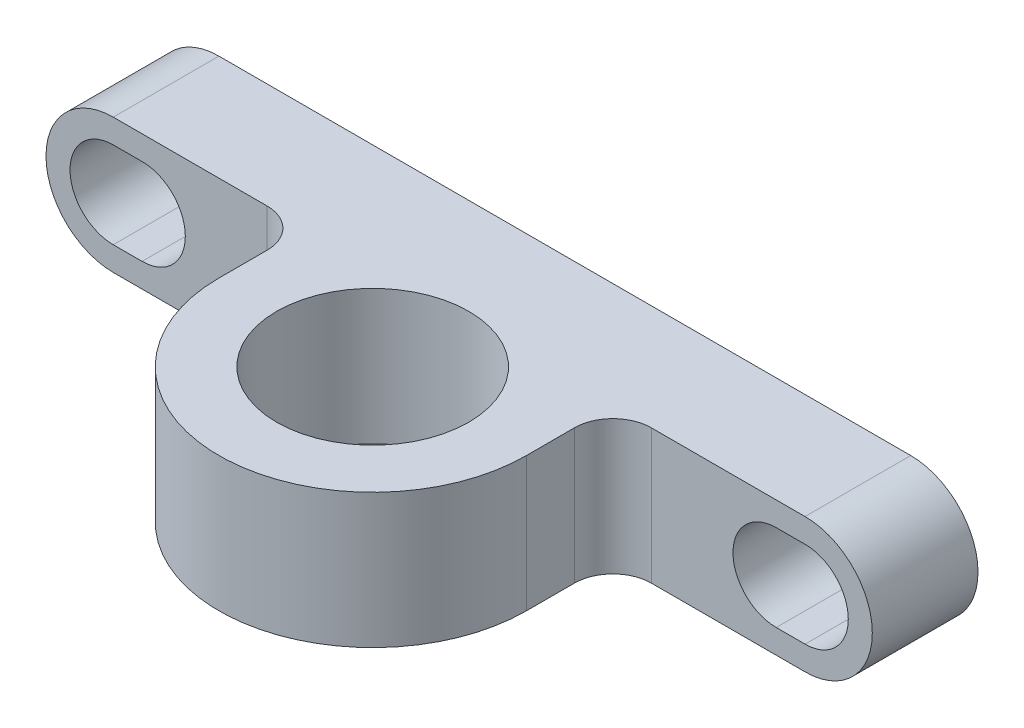
ISO-10303-21;
HEADER;
FILE_DESCRIPTION(('STEP AP214'),'2;1');
FILE_NAME('part.step','',(''),(''),'','','');
FILE_SCHEMA(('AUTOMOTIVE_DESIGN { 1 0 10303 214 1 1 1 1 }'));
ENDSEC;
DATA;
#1=APPLICATION_CONTEXT('core data for automotive mechanical design processes');
#2=APPLICATION_PROTOCOL_DEFINITION('international standard','automotive_design',2000,#1);
#3=PRODUCT_CONTEXT('',#1,'mechanical');
#4=PRODUCT('Part','Part','',(#3));
#5=PRODUCT_RELATED_PRODUCT_CATEGORY('part','',(#4));
#6=PRODUCT_DEFINITION_FORMATION('','',#4);
#7=PRODUCT_DEFINITION_CONTEXT('part definition',#1,'design');
#8=PRODUCT_DEFINITION('design','',#6,#7);
#9=PRODUCT_DEFINITION_SHAPE('','',#8);
#10=(LENGTH_UNIT() NAMED_UNIT(*) SI_UNIT(.MILLI.,.METRE.));
#11=(NAMED_UNIT(*) PLANE_ANGLE_UNIT() SI_UNIT($,.RADIAN.));
#12=(NAMED_UNIT(*) SI_UNIT($,.STERADIAN.) SOLID_ANGLE_UNIT());
#13=UNCERTAINTY_MEASURE_WITH_UNIT(LENGTH_MEASURE(1.E-05),#10,'distance_accuracy_value','');
#14=(GEOMETRIC_REPRESENTATION_CONTEXT(3) GLOBAL_UNCERTAINTY_ASSIGNED_CONTEXT((#13)) GLOBAL_UNIT_ASSIGNED_CONTEXT((#10,
#11,#12)) REPRESENTATION_CONTEXT('',''));
#15=CARTESIAN_POINT('',(0.,0.,0.));
#16=DIRECTION('',(0.,0.,1.));
#17=DIRECTION('',(1.,0.,0.));
#18=AXIS2_PLACEMENT_3D('',#15,#16,#17);
#19=CARTESIAN_POINT('',(0.,-3.5,-4.651828343263));
#20=DIRECTION('',(0.,-1.,0.));
#21=DIRECTION('',(0.,0.,-1.));
#22=AXIS2_PLACEMENT_3D('',#19,#20,#21);
#23=PLANE('',#22);
#24=DIRECTION('',(1.,0.,0.));
#25=VECTOR('',#24,1.);
#26=CARTESIAN_POINT('',(-17.9999735424187,-3.5,-4.5));
#27=LINE('',#26,#25);
#28=CARTESIAN_POINT('',(-17.9999867712094,-3.49999999995,-4.5));
#29=VERTEX_POINT('',#28);
#30=CARTESIAN_POINT('',(-10.0000000001,-3.5,-4.5));
#31=VERTEX_POINT('',#30);
#32=EDGE_CURVE('E467',#29,#31,#27,.T.);
#33=ORIENTED_EDGE('',*,*,#32,.F.);
#34=DIRECTION('',(0.,0.,-1.));
#35=VECTOR('',#34,1.);
#36=CARTESIAN_POINT('',(-18.,-3.5,-4.651828343263));
#37=LINE('',#36,#35);
#38=CARTESIAN_POINT('',(-18.,-3.49999999995,-10.));
#39=VERTEX_POINT('',#38);
#40=EDGE_CURVE('E211',#29,#39,#37,.T.);
#41=ORIENTED_EDGE('',*,*,#40,.T.);
#42=DIRECTION('',(1.,0.,0.));
#43=VECTOR('',#42,1.);
#44=CARTESIAN_POINT('',(0.,-3.5,-10.));
#45=LINE('',#44,#43);
#46=CARTESIAN_POINT('',(18.,-3.49999999995,-10.));
#47=VERTEX_POINT('',#46);
#48=EDGE_CURVE('E201',#39,#47,#45,.T.);
#49=ORIENTED_EDGE('',*,*,#48,.T.);
#50=DIRECTION('',(0.,0.,-1.));
#51=VECTOR('',#50,1.);
#52=CARTESIAN_POINT('',(18.,-3.5,-4.651828343263));
#53=LINE('',#52,#51);
#54=CARTESIAN_POINT('',(17.9999867712094,-3.49999999995,-4.49999999990001));
#55=VERTEX_POINT('',#54);
#56=EDGE_CURVE('E220',#47,#55,#53,.F.);
#57=ORIENTED_EDGE('',*,*,#56,.T.);
#58=DIRECTION('',(1.,0.,0.));
#59=VECTOR('',#58,1.);
#60=CARTESIAN_POINT('',(7.9999999999,-3.5,-4.49999999990001));
#61=LINE('',#60,#59);
#62=CARTESIAN_POINT('',(9.9999999999,-3.5,-4.49999999990001));
#63=VERTEX_POINT('',#62);
#64=EDGE_CURVE('E332',#63,#55,#61,.T.);
#65=ORIENTED_EDGE('',*,*,#64,.F.);
#66=CARTESIAN_POINT('',(9.9999999999,-3.5,-2.49999999990001));
#67=DIRECTION('',(0.,-1.,0.));
#68=DIRECTION('',(0.,0.,-1.));
#69=AXIS2_PLACEMENT_3D('',#66,#67,#68);
#70=CIRCLE('',#69,2.);
#71=CARTESIAN_POINT('',(7.9999999999,-3.5,-2.49999999990001));
#72=VERTEX_POINT('',#71);
#73=EDGE_CURVE('E56',#63,#72,#70,.F.);
#74=ORIENTED_EDGE('',*,*,#73,.T.);
#75=DIRECTION('',(0.,0.,1.));
#76=VECTOR('',#75,1.);
#77=CARTESIAN_POINT('',(7.9999999999,-3.5,-4.49999999990001));
#78=LINE('',#77,#76);
#79=CARTESIAN_POINT('',(7.9999999999,-3.5,0.));
#80=VERTEX_POINT('',#79);
#81=EDGE_CURVE('E448',#72,#80,#78,.T.);
#82=ORIENTED_EDGE('',*,*,#81,.T.);
#83=CARTESIAN_POINT('',(0.,-3.5,0.00126554336339));
#84=DIRECTION('',(0.,1.,0.));
#85=DIRECTION('',(0.,0.,1.));
#86=AXIS2_PLACEMENT_3D('',#83,#84,#85);
#87=CIRCLE('',#86,8.0000001);
#88=CARTESIAN_POINT('',(-8.,-3.5,0.));
#89=VERTEX_POINT('',#88);
#90=EDGE_CURVE('E217',#80,#89,#87,.F.);
#91=ORIENTED_EDGE('',*,*,#90,.T.);
#92=DIRECTION('',(0.,0.,1.));
#93=VECTOR('',#92,1.);
#94=CARTESIAN_POINT('',(-8.0000000001,-3.5,-4.5));
#95=LINE('',#94,#93);
#96=CARTESIAN_POINT('',(-8.0000000001,-3.5,-2.5));
#97=VERTEX_POINT('',#96);
#98=EDGE_CURVE('E183',#97,#89,#95,.T.);
#99=ORIENTED_EDGE('',*,*,#98,.F.);
#100=CARTESIAN_POINT('',(-10.0000000001,-3.5,-2.5));
#101=DIRECTION('',(0.,-1.,0.));
#102=DIRECTION('',(0.,0.,-1.));
#103=AXIS2_PLACEMENT_3D('',#100,#101,#102);
#104=CIRCLE('',#103,2.);
#105=EDGE_CURVE('E319',#97,#31,#104,.F.);
#106=ORIENTED_EDGE('',*,*,#105,.T.);
#107=EDGE_LOOP('',(#33,#41,#49,#57,#65,#74,#82,#91,#99,#106));
#108=FACE_BOUND('',#107,.T.);
#109=CARTESIAN_POINT('',(0.,-3.5,0.));
#110=DIRECTION('',(0.,-1.,0.));
#111=DIRECTION('',(0.,0.,-1.));
#112=AXIS2_PLACEMENT_3D('',#109,#110,#111);
#113=CIRCLE('',#112,5.);
#114=CARTESIAN_POINT('',(0.,-3.5,-5.));
#115=VERTEX_POINT('',#114);
#116=EDGE_CURVE('E496',#115,#115,#113,.T.);
#117=ORIENTED_EDGE('',*,*,#116,.F.);
#118=EDGE_LOOP('',(#117));
#119=FACE_BOUND('',#118,.T.);
#120=ADVANCED_FACE('F48',(#108,#119),#23,.T.);
#121=CARTESIAN_POINT('',(0.,3.5,-4.651828343263));
#122=DIRECTION('',(0.,-1.,0.));
#123=DIRECTION('',(0.,0.,-1.));
#124=AXIS2_PLACEMENT_3D('',#121,#122,#123);
#125=PLANE('',#124);
#126=DIRECTION('',(0.,0.,-1.));
#127=VECTOR('',#126,1.);
#128=CARTESIAN_POINT('',(-18.,3.5,-4.651828343263));
#129=LINE('',#128,#127);
#130=CARTESIAN_POINT('',(-17.9999867712094,3.5000000001,-4.5));
#131=VERTEX_POINT('',#130);
#132=CARTESIAN_POINT('',(-18.,3.49999999995,-10.));
#133=VERTEX_POINT('',#132);
#134=EDGE_CURVE('E200',#131,#133,#129,.T.);
#135=ORIENTED_EDGE('',*,*,#134,.F.);
#136=DIRECTION('',(-1.,0.,0.));
#137=VECTOR('',#136,1.);
#138=CARTESIAN_POINT('',(-8.0000000001,3.50000000015,-4.5));
#139=LINE('',#138,#137);
#140=CARTESIAN_POINT('',(-10.0000000001,3.50000000015,-4.5));
#141=VERTEX_POINT('',#140);
#142=EDGE_CURVE('E465',#141,#131,#139,.T.);
#143=ORIENTED_EDGE('',*,*,#142,.F.);
#144=CARTESIAN_POINT('',(-10.0000000001,3.5,-2.5));
#145=DIRECTION('',(0.,-1.,0.));
#146=DIRECTION('',(0.,0.,-1.));
#147=AXIS2_PLACEMENT_3D('',#144,#145,#146);
#148=CIRCLE('',#147,2.);
#149=CARTESIAN_POINT('',(-8.0000000001,3.50000000015,-2.5));
#150=VERTEX_POINT('',#149);
#151=EDGE_CURVE('E179',#141,#150,#148,.T.);
#152=ORIENTED_EDGE('',*,*,#151,.T.);
#153=DIRECTION('',(0.,0.,1.));
#154=VECTOR('',#153,1.);
#155=CARTESIAN_POINT('',(-8.0000000001,3.50000000015,-4.5));
#156=LINE('',#155,#154);
#157=CARTESIAN_POINT('',(-8.0000000001,3.50000000015,0.));
#158=VERTEX_POINT('',#157);
#159=EDGE_CURVE('E171',#150,#158,#156,.T.);
#160=ORIENTED_EDGE('',*,*,#159,.T.);
#161=CARTESIAN_POINT('',(0.,3.5,0.00126554336339));
#162=DIRECTION('',(0.,1.,0.));
#163=DIRECTION('',(0.,0.,1.));
#164=AXIS2_PLACEMENT_3D('',#161,#162,#163);
#165=CIRCLE('',#164,8.0000001);
#166=CARTESIAN_POINT('',(7.999999999925,3.5,0.));
#167=VERTEX_POINT('',#166);
#168=EDGE_CURVE('E177',#167,#158,#165,.F.);
#169=ORIENTED_EDGE('',*,*,#168,.F.);
#170=DIRECTION('',(0.,0.,1.));
#171=VECTOR('',#170,1.);
#172=CARTESIAN_POINT('',(7.9999999999,3.50000000015,-4.49999999990001));
#173=LINE('',#172,#171);
#174=CARTESIAN_POINT('',(7.9999999999,3.50000000015,-2.49999999990001));
#175=VERTEX_POINT('',#174);
#176=EDGE_CURVE('E335',#175,#167,#173,.T.);
#177=ORIENTED_EDGE('',*,*,#176,.F.);
#178=CARTESIAN_POINT('',(9.9999999999,3.5,-2.49999999990001));
#179=DIRECTION('',(0.,-1.,0.));
#180=DIRECTION('',(0.,0.,-1.));
#181=AXIS2_PLACEMENT_3D('',#178,#179,#180);
#182=CIRCLE('',#181,2.);
#183=CARTESIAN_POINT('',(9.9999999999,3.50000000015,-4.49999999990001));
#184=VERTEX_POINT('',#183);
#185=EDGE_CURVE('E13',#175,#184,#182,.T.);
#186=ORIENTED_EDGE('',*,*,#185,.T.);
#187=DIRECTION('',(-1.,0.,0.));
#188=VECTOR('',#187,1.);
#189=CARTESIAN_POINT('',(17.9999735424187,3.50000000015,-4.49999999990001));
#190=LINE('',#189,#188);
#191=CARTESIAN_POINT('',(17.9999867712094,3.5000000001,-4.49999999990001));
#192=VERTEX_POINT('',#191);
#193=EDGE_CURVE('E336',#192,#184,#190,.T.);
#194=ORIENTED_EDGE('',*,*,#193,.F.);
#195=DIRECTION('',(0.,0.,-1.));
#196=VECTOR('',#195,1.);
#197=CARTESIAN_POINT('',(18.,3.5,-4.651828343263));
#198=LINE('',#197,#196);
#199=CARTESIAN_POINT('',(18.,3.49999999995,-10.));
#200=VERTEX_POINT('',#199);
#201=EDGE_CURVE('E369',#200,#192,#198,.F.);
#202=ORIENTED_EDGE('',*,*,#201,.F.);
#203=DIRECTION('',(1.,0.,0.));
#204=VECTOR('',#203,1.);
#205=CARTESIAN_POINT('',(0.,3.5,-10.));
#206=LINE('',#205,#204);
#207=EDGE_CURVE('E208',#133,#200,#206,.T.);
#208=ORIENTED_EDGE('',*,*,#207,.F.);
#209=EDGE_LOOP('',(#135,#143,#152,#160,#169,#177,#186,#194,#202,#208));
#210=FACE_BOUND('',#209,.T.);
#211=CARTESIAN_POINT('',(0.,3.5,0.));
#212=DIRECTION('',(0.,-1.,0.));
#213=DIRECTION('',(0.,0.,-1.));
#214=AXIS2_PLACEMENT_3D('',#211,#212,#213);
#215=CIRCLE('',#214,5.);
#216=CARTESIAN_POINT('',(0.,3.5,-5.));
#217=VERTEX_POINT('',#216);
#218=EDGE_CURVE('E490',#217,#217,#215,.F.);
#219=ORIENTED_EDGE('',*,*,#218,.F.);
#220=EDGE_LOOP('',(#219));
#221=FACE_BOUND('',#220,.T.);
#222=ADVANCED_FACE('F174',(#210,#221),#125,.F.);
#223=CARTESIAN_POINT('',(-18.,2.2499999999,-10.));
#224=DIRECTION('',(0.,1.,0.));
#225=DIRECTION('',(0.,0.,1.));
#226=AXIS2_PLACEMENT_3D('',#223,#224,#225);
#227=PLANE('',#226);
#228=DIRECTION('',(-1.,0.,0.));
#229=VECTOR('',#228,1.);
#230=CARTESIAN_POINT('',(-18.0000212132043,2.2499999999,-4.5));
#231=LINE('',#230,#229);
#232=CARTESIAN_POINT('',(-16.4999893933978,2.2499999999,-4.5));
#233=VERTEX_POINT('',#232);
#234=CARTESIAN_POINT('',(-18.0000106066022,2.2499999999,-4.5));
#235=VERTEX_POINT('',#234);
#236=EDGE_CURVE('E473',#233,#235,#231,.T.);
#237=ORIENTED_EDGE('',*,*,#236,.T.);
#238=DIRECTION('',(0.,0.,-1.));
#239=VECTOR('',#238,1.);
#240=CARTESIAN_POINT('',(-18.,2.2499999999,-10.));
#241=LINE('',#240,#239);
#242=CARTESIAN_POINT('',(-18.,2.2499999999,-10.));
#243=VERTEX_POINT('',#242);
#244=EDGE_CURVE('E705',#235,#243,#241,.T.);
#245=ORIENTED_EDGE('',*,*,#244,.T.);
#246=DIRECTION('',(1.,0.,0.));
#247=VECTOR('',#246,1.);
#248=CARTESIAN_POINT('',(-18.,2.2499999999,-10.));
#249=LINE('',#248,#247);
#250=CARTESIAN_POINT('',(-16.5,2.2499999999,-10.));
#251=VERTEX_POINT('',#250);
#252=EDGE_CURVE('E215',#251,#243,#249,.F.);
#253=ORIENTED_EDGE('',*,*,#252,.F.);
#254=DIRECTION('',(0.,0.,-1.));
#255=VECTOR('',#254,1.);
#256=CARTESIAN_POINT('',(-16.5,2.2499999999,-10.));
#257=LINE('',#256,#255);
#258=EDGE_CURVE('E708',#251,#233,#257,.F.);
#259=ORIENTED_EDGE('',*,*,#258,.T.);
#260=EDGE_LOOP('',(#237,#245,#253,#259));
#261=FACE_BOUND('',#260,.T.);
#262=ADVANCED_FACE('F301',(#261),#227,.F.);
#263=CARTESIAN_POINT('',(-17.25,-2.25,-10.));
#264=DIRECTION('',(0.,-1.,0.));
#265=DIRECTION('',(0.,0.,-1.));
#266=AXIS2_PLACEMENT_3D('',#263,#264,#265);
#267=PLANE('',#266);
#268=DIRECTION('',(1.,0.,0.));
#269=VECTOR('',#268,1.);
#270=CARTESIAN_POINT('',(-16.4999787867957,-2.25000000015,-4.5));
#271=LINE('',#270,#269);
#272=CARTESIAN_POINT('',(-18.0000106066022,-2.25000000015,-4.5));
#273=VERTEX_POINT('',#272);
#274=CARTESIAN_POINT('',(-16.4999893933978,-2.25000000015,-4.5));
#275=VERTEX_POINT('',#274);
#276=EDGE_CURVE('E489',#273,#275,#271,.T.);
#277=ORIENTED_EDGE('',*,*,#276,.T.);
#278=DIRECTION('',(0.,0.,-1.));
#279=VECTOR('',#278,1.);
#280=CARTESIAN_POINT('',(-16.5,-2.2499999999,-10.));
#281=LINE('',#280,#279);
#282=CARTESIAN_POINT('',(-16.5,-2.24999999995,-10.));
#283=VERTEX_POINT('',#282);
#284=EDGE_CURVE('E712',#275,#283,#281,.T.);
#285=ORIENTED_EDGE('',*,*,#284,.T.);
#286=DIRECTION('',(1.,0.,0.));
#287=VECTOR('',#286,1.);
#288=CARTESIAN_POINT('',(-17.25,-2.25,-10.));
#289=LINE('',#288,#287);
#290=CARTESIAN_POINT('',(-18.,-2.24999999995,-10.));
#291=VERTEX_POINT('',#290);
#292=EDGE_CURVE('E436',#291,#283,#289,.T.);
#293=ORIENTED_EDGE('',*,*,#292,.F.);
#294=DIRECTION('',(0.,0.,-1.));
#295=VECTOR('',#294,1.);
#296=CARTESIAN_POINT('',(-18.,-2.2499999999,-10.));
#297=LINE('',#296,#295);
#298=EDGE_CURVE('E430',#291,#273,#297,.F.);
#299=ORIENTED_EDGE('',*,*,#298,.T.);
#300=EDGE_LOOP('',(#277,#285,#293,#299));
#301=FACE_BOUND('',#300,.T.);
#302=ADVANCED_FACE('F291',(#301),#267,.F.);
#303=CARTESIAN_POINT('',(-18.0000212132043,0.,-10.));
#304=DIRECTION('',(0.,0.,-1.));
#305=DIRECTION('',(-1.,0.,0.));
#306=AXIS2_PLACEMENT_3D('',#303,#304,#305);
#307=CYLINDRICAL_SURFACE('',#306,2.25);
#308=ORIENTED_EDGE('',*,*,#244,.F.);
#309=CARTESIAN_POINT('',(-18.0000212132043,-1.24999826461868E-10,-4.5));
#310=DIRECTION('',(0.,0.,1.));
#311=DIRECTION('',(-1.,0.,0.));
#312=AXIS2_PLACEMENT_3D('',#309,#310,#311);
#313=CIRCLE('',#312,2.250000000025);
#314=EDGE_CURVE('E487',#235,#273,#313,.T.);
#315=ORIENTED_EDGE('',*,*,#314,.T.);
#316=ORIENTED_EDGE('',*,*,#298,.F.);
#317=CARTESIAN_POINT('',(-18.0000212132043,0.,-10.));
#318=DIRECTION('',(0.,0.,-1.));
#319=DIRECTION('',(-1.,0.,0.));
#320=AXIS2_PLACEMENT_3D('',#317,#318,#319);
#321=CIRCLE('',#320,2.25);
#322=EDGE_CURVE('E803',#243,#291,#321,.F.);
#323=ORIENTED_EDGE('',*,*,#322,.F.);
#324=EDGE_LOOP('',(#308,#315,#316,#323));
#325=FACE_BOUND('',#324,.T.);
#326=ADVANCED_FACE('F274',(#325),#307,.F.);
#327=CARTESIAN_POINT('',(-17.9999735424187,0.,0.));
#328=DIRECTION('',(0.,0.,1.));
#329=DIRECTION('',(1.,0.,0.));
#330=AXIS2_PLACEMENT_3D('',#327,#328,#329);
#331=CYLINDRICAL_SURFACE('',#330,3.5);
#332=ORIENTED_EDGE('',*,*,#40,.F.);
#333=CARTESIAN_POINT('',(-17.9999735424187,7.50003566196503E-11,-4.5));
#334=DIRECTION('',(0.,0.,1.));
#335=DIRECTION('',(1.,0.,0.));
#336=AXIS2_PLACEMENT_3D('',#333,#334,#335);
#337=CIRCLE('',#336,3.500000000075);
#338=EDGE_CURVE('E471',#131,#29,#337,.T.);
#339=ORIENTED_EDGE('',*,*,#338,.F.);
#340=ORIENTED_EDGE('',*,*,#134,.T.);
#341=CARTESIAN_POINT('',(-17.9999735424187,0.,-10.));
#342=DIRECTION('',(0.,0.,1.));
#343=DIRECTION('',(1.,0.,0.));
#344=AXIS2_PLACEMENT_3D('',#341,#342,#343);
#345=CIRCLE('',#344,3.5);
#346=EDGE_CURVE('E193',#39,#133,#345,.F.);
#347=ORIENTED_EDGE('',*,*,#346,.F.);
#348=EDGE_LOOP('',(#332,#339,#340,#347));
#349=FACE_BOUND('',#348,.T.);
#350=ADVANCED_FACE('F270',(#349),#331,.T.);
#351=CARTESIAN_POINT('',(16.5,2.2499999999,-10.));
#352=DIRECTION('',(0.,1.,0.));
#353=DIRECTION('',(0.,0.,1.));
#354=AXIS2_PLACEMENT_3D('',#351,#352,#353);
#355=PLANE('',#354);
#356=DIRECTION('',(-1.,0.,0.));
#357=VECTOR('',#356,1.);
#358=CARTESIAN_POINT('',(16.4999787867957,2.2499999999,-4.49999999990001));
#359=LINE('',#358,#357);
#360=CARTESIAN_POINT('',(18.0000106066022,2.2499999999,-4.49999999990001));
#361=VERTEX_POINT('',#360);
#362=CARTESIAN_POINT('',(16.4999893933978,2.2499999999,-4.49999999990001));
#363=VERTEX_POINT('',#362);
#364=EDGE_CURVE('E359',#361,#363,#359,.T.);
#365=ORIENTED_EDGE('',*,*,#364,.T.);
#366=DIRECTION('',(0.,0.,-1.));
#367=VECTOR('',#366,1.);
#368=CARTESIAN_POINT('',(16.5,2.2499999999,-10.));
#369=LINE('',#368,#367);
#370=CARTESIAN_POINT('',(16.5,2.2499999999,-10.));
#371=VERTEX_POINT('',#370);
#372=EDGE_CURVE('E385',#363,#371,#369,.T.);
#373=ORIENTED_EDGE('',*,*,#372,.T.);
#374=DIRECTION('',(1.,0.,0.));
#375=VECTOR('',#374,1.);
#376=CARTESIAN_POINT('',(16.5,2.2499999999,-10.));
#377=LINE('',#376,#375);
#378=CARTESIAN_POINT('',(18.,2.2499999999,-10.));
#379=VERTEX_POINT('',#378);
#380=EDGE_CURVE('E431',#379,#371,#377,.F.);
#381=ORIENTED_EDGE('',*,*,#380,.F.);
#382=DIRECTION('',(0.,0.,-1.));
#383=VECTOR('',#382,1.);
#384=CARTESIAN_POINT('',(18.,2.2499999999,-10.));
#385=LINE('',#384,#383);
#386=EDGE_CURVE('E738',#379,#361,#385,.F.);
#387=ORIENTED_EDGE('',*,*,#386,.T.);
#388=EDGE_LOOP('',(#365,#373,#381,#387));
#389=FACE_BOUND('',#388,.T.);
#390=ADVANCED_FACE('F273',(#389),#355,.F.);
#391=CARTESIAN_POINT('',(17.25,-2.25,-10.));
#392=DIRECTION('',(0.,-1.,0.));
#393=DIRECTION('',(0.,0.,-1.));
#394=AXIS2_PLACEMENT_3D('',#391,#392,#393);
#395=PLANE('',#394);
#396=DIRECTION('',(1.,0.,0.));
#397=VECTOR('',#396,1.);
#398=CARTESIAN_POINT('',(18.0000212132043,-2.25000000015,-4.49999999990001));
#399=LINE('',#398,#397);
#400=CARTESIAN_POINT('',(16.4999893933978,-2.25000000015,-4.49999999990001));
#401=VERTEX_POINT('',#400);
#402=CARTESIAN_POINT('',(18.0000106066022,-2.25000000015,-4.49999999990001));
#403=VERTEX_POINT('',#402);
#404=EDGE_CURVE('E343',#401,#403,#399,.T.);
#405=ORIENTED_EDGE('',*,*,#404,.T.);
#406=DIRECTION('',(0.,0.,-1.));
#407=VECTOR('',#406,1.);
#408=CARTESIAN_POINT('',(18.,-2.2499999999,-10.));
#409=LINE('',#408,#407);
#410=CARTESIAN_POINT('',(18.,-2.24999999995,-10.));
#411=VERTEX_POINT('',#410);
#412=EDGE_CURVE('E400',#403,#411,#409,.T.);
#413=ORIENTED_EDGE('',*,*,#412,.T.);
#414=DIRECTION('',(1.,0.,0.));
#415=VECTOR('',#414,1.);
#416=CARTESIAN_POINT('',(17.25,-2.25,-10.));
#417=LINE('',#416,#415);
#418=CARTESIAN_POINT('',(16.5,-2.24999999995,-10.));
#419=VERTEX_POINT('',#418);
#420=EDGE_CURVE('E424',#419,#411,#417,.T.);
#421=ORIENTED_EDGE('',*,*,#420,.F.);
#422=DIRECTION('',(0.,0.,-1.));
#423=VECTOR('',#422,1.);
#424=CARTESIAN_POINT('',(16.5,-2.2499999999,-10.));
#425=LINE('',#424,#423);
#426=EDGE_CURVE('E715',#419,#401,#425,.F.);
#427=ORIENTED_EDGE('',*,*,#426,.T.);
#428=EDGE_LOOP('',(#405,#413,#421,#427));
#429=FACE_BOUND('',#428,.T.);
#430=ADVANCED_FACE('F284',(#429),#395,.F.);
#431=CARTESIAN_POINT('',(16.4999787867957,0.,-10.));
#432=DIRECTION('',(0.,0.,-1.));
#433=DIRECTION('',(-1.,0.,0.));
#434=AXIS2_PLACEMENT_3D('',#431,#432,#433);
#435=CYLINDRICAL_SURFACE('',#434,2.25);
#436=ORIENTED_EDGE('',*,*,#372,.F.);
#437=CARTESIAN_POINT('',(16.4999787867957,-1.24999826461868E-10,-4.49999999990001));
#438=DIRECTION('',(0.,0.,1.));
#439=DIRECTION('',(-1.,0.,0.));
#440=AXIS2_PLACEMENT_3D('',#437,#438,#439);
#441=CIRCLE('',#440,2.250000000025);
#442=EDGE_CURVE('E182',#363,#401,#441,.T.);
#443=ORIENTED_EDGE('',*,*,#442,.T.);
#444=ORIENTED_EDGE('',*,*,#426,.F.);
#445=CARTESIAN_POINT('',(16.4999787867957,0.,-10.));
#446=DIRECTION('',(0.,0.,-1.));
#447=DIRECTION('',(-1.,0.,0.));
#448=AXIS2_PLACEMENT_3D('',#445,#446,#447);
#449=CIRCLE('',#448,2.25);
#450=EDGE_CURVE('E817',#371,#419,#449,.F.);
#451=ORIENTED_EDGE('',*,*,#450,.F.);
#452=EDGE_LOOP('',(#436,#443,#444,#451));
#453=FACE_BOUND('',#452,.T.);
#454=ADVANCED_FACE('F263',(#453),#435,.F.);
#455=CARTESIAN_POINT('',(17.9999735424187,0.,0.));
#456=DIRECTION('',(0.,0.,1.));
#457=DIRECTION('',(1.,0.,0.));
#458=AXIS2_PLACEMENT_3D('',#455,#456,#457);
#459=CYLINDRICAL_SURFACE('',#458,3.5);
#460=ORIENTED_EDGE('',*,*,#201,.T.);
#461=CARTESIAN_POINT('',(17.9999735424187,7.50003149863262E-11,-4.49999999990001));
#462=DIRECTION('',(0.,0.,1.));
#463=DIRECTION('',(1.,0.,0.));
#464=AXIS2_PLACEMENT_3D('',#461,#462,#463);
#465=CIRCLE('',#464,3.500000000075);
#466=EDGE_CURVE('E362',#55,#192,#465,.T.);
#467=ORIENTED_EDGE('',*,*,#466,.F.);
#468=ORIENTED_EDGE('',*,*,#56,.F.);
#469=CARTESIAN_POINT('',(17.9999735424187,0.,-10.));
#470=DIRECTION('',(0.,0.,1.));
#471=DIRECTION('',(1.,0.,0.));
#472=AXIS2_PLACEMENT_3D('',#469,#470,#471);
#473=CIRCLE('',#472,3.5);
#474=EDGE_CURVE('E221',#47,#200,#473,.T.);
#475=ORIENTED_EDGE('',*,*,#474,.T.);
#476=EDGE_LOOP('',(#460,#467,#468,#475));
#477=FACE_BOUND('',#476,.T.);
#478=ADVANCED_FACE('F259',(#477),#459,.T.);
#479=CARTESIAN_POINT('',(-16.4999787867957,0.,-10.));
#480=DIRECTION('',(0.,0.,-1.));
#481=DIRECTION('',(-1.,0.,0.));
#482=AXIS2_PLACEMENT_3D('',#479,#480,#481);
#483=CYLINDRICAL_SURFACE('',#482,2.25);
#484=CARTESIAN_POINT('',(-16.4999787867957,-1.24999836870199E-10,-4.5));
#485=DIRECTION('',(0.,0.,1.));
#486=DIRECTION('',(-1.,0.,0.));
#487=AXIS2_PLACEMENT_3D('',#484,#485,#486);
#488=CIRCLE('',#487,2.250000000025);
#489=EDGE_CURVE('E484',#275,#233,#488,.T.);
#490=ORIENTED_EDGE('',*,*,#489,.T.);
#491=ORIENTED_EDGE('',*,*,#258,.F.);
#492=CARTESIAN_POINT('',(-16.4999787867957,0.,-10.));
#493=DIRECTION('',(0.,0.,-1.));
#494=DIRECTION('',(-1.,0.,0.));
#495=AXIS2_PLACEMENT_3D('',#492,#493,#494);
#496=CIRCLE('',#495,2.25);
#497=EDGE_CURVE('E810',#283,#251,#496,.F.);
#498=ORIENTED_EDGE('',*,*,#497,.F.);
#499=ORIENTED_EDGE('',*,*,#284,.F.);
#500=EDGE_LOOP('',(#490,#491,#498,#499));
#501=FACE_BOUND('',#500,.T.);
#502=ADVANCED_FACE('F262',(#501),#483,.F.);
#503=CARTESIAN_POINT('',(18.0000212132043,0.,-10.));
#504=DIRECTION('',(0.,0.,-1.));
#505=DIRECTION('',(-1.,0.,0.));
#506=AXIS2_PLACEMENT_3D('',#503,#504,#505);
#507=CYLINDRICAL_SURFACE('',#506,2.25);
#508=CARTESIAN_POINT('',(18.0000212132043,-1.24999836870199E-10,-4.49999999990001));
#509=DIRECTION('',(0.,0.,1.));
#510=DIRECTION('',(-1.,0.,0.));
#511=AXIS2_PLACEMENT_3D('',#508,#509,#510);
#512=CIRCLE('',#511,2.250000000025);
#513=EDGE_CURVE('E347',#403,#361,#512,.T.);
#514=ORIENTED_EDGE('',*,*,#513,.T.);
#515=ORIENTED_EDGE('',*,*,#386,.F.);
#516=CARTESIAN_POINT('',(18.0000212132043,0.,-10.));
#517=DIRECTION('',(0.,0.,-1.));
#518=DIRECTION('',(-1.,0.,0.));
#519=AXIS2_PLACEMENT_3D('',#516,#517,#518);
#520=CIRCLE('',#519,2.25);
#521=EDGE_CURVE('E225',#411,#379,#520,.F.);
#522=ORIENTED_EDGE('',*,*,#521,.F.);
#523=ORIENTED_EDGE('',*,*,#412,.F.);
#524=EDGE_LOOP('',(#514,#515,#522,#523));
#525=FACE_BOUND('',#524,.T.);
#526=ADVANCED_FACE('F278',(#525),#507,.F.);
#527=CARTESIAN_POINT('',(0.,3.5,0.00126554336339));
#528=DIRECTION('',(0.,1.,0.));
#529=DIRECTION('',(0.,0.,1.));
#530=AXIS2_PLACEMENT_3D('',#527,#528,#529);
#531=CYLINDRICAL_SURFACE('',#530,8.0000001);
#532=ORIENTED_EDGE('',*,*,#168,.T.);
#533=DIRECTION('',(0.,1.,0.));
#534=VECTOR('',#533,1.);
#535=CARTESIAN_POINT('',(-8.0000000001,3.5,0.));
#536=LINE('',#535,#534);
#537=EDGE_CURVE('E186',#89,#158,#536,.T.);
#538=ORIENTED_EDGE('',*,*,#537,.F.);
#539=ORIENTED_EDGE('',*,*,#90,.F.);
#540=DIRECTION('',(0.,1.,0.));
#541=VECTOR('',#540,1.);
#542=CARTESIAN_POINT('',(7.9999999999,3.5,0.));
#543=LINE('',#542,#541);
#544=EDGE_CURVE('E194',#80,#167,#543,.T.);
#545=ORIENTED_EDGE('',*,*,#544,.T.);
#546=EDGE_LOOP('',(#532,#538,#539,#545));
#547=FACE_BOUND('',#546,.T.);
#548=ADVANCED_FACE('F197',(#547),#531,.T.);
#549=CARTESIAN_POINT('',(21.5,3.5,-10.));
#550=DIRECTION('',(0.,0.,-1.));
#551=DIRECTION('',(-1.,0.,0.));
#552=AXIS2_PLACEMENT_3D('',#549,#550,#551);
#553=PLANE('',#552);
#554=ORIENTED_EDGE('',*,*,#521,.T.);
#555=ORIENTED_EDGE('',*,*,#380,.T.);
#556=ORIENTED_EDGE('',*,*,#450,.T.);
#557=ORIENTED_EDGE('',*,*,#420,.T.);
#558=EDGE_LOOP('',(#554,#555,#556,#557));
#559=FACE_BOUND('',#558,.T.);
#560=ORIENTED_EDGE('',*,*,#497,.T.);
#561=ORIENTED_EDGE('',*,*,#252,.T.);
#562=ORIENTED_EDGE('',*,*,#322,.T.);
#563=ORIENTED_EDGE('',*,*,#292,.T.);
#564=EDGE_LOOP('',(#560,#561,#562,#563));
#565=FACE_BOUND('',#564,.T.);
#566=ORIENTED_EDGE('',*,*,#346,.T.);
#567=ORIENTED_EDGE('',*,*,#207,.T.);
#568=ORIENTED_EDGE('',*,*,#474,.F.);
#569=ORIENTED_EDGE('',*,*,#48,.F.);
#570=EDGE_LOOP('',(#566,#567,#568,#569));
#571=FACE_BOUND('',#570,.T.);
#572=ADVANCED_FACE('F265',(#559,#565,#571),#553,.T.);
#573=CARTESIAN_POINT('',(7.9999999999,3.50000000015,-4.49999999990001));
#574=DIRECTION('',(-1.,0.,0.));
#575=DIRECTION('',(0.,0.,1.));
#576=AXIS2_PLACEMENT_3D('',#573,#574,#575);
#577=PLANE('',#576);
#578=ORIENTED_EDGE('',*,*,#81,.F.);
#579=DIRECTION('',(0.,-1.,0.));
#580=VECTOR('',#579,1.);
#581=CARTESIAN_POINT('',(7.9999999999,3.50000000015,-2.49999999990001));
#582=LINE('',#581,#580);
#583=EDGE_CURVE('E63',#72,#175,#582,.F.);
#584=ORIENTED_EDGE('',*,*,#583,.T.);
#585=ORIENTED_EDGE('',*,*,#176,.T.);
#586=ORIENTED_EDGE('',*,*,#544,.F.);
#587=EDGE_LOOP('',(#578,#584,#585,#586));
#588=FACE_BOUND('',#587,.T.);
#589=ADVANCED_FACE('F268',(#588),#577,.F.);
#590=CARTESIAN_POINT('',(17.9999735424187,7.50003149863262E-11,-4.49999999990001));
#591=DIRECTION('',(0.,0.,1.));
#592=DIRECTION('',(1.,0.,0.));
#593=AXIS2_PLACEMENT_3D('',#590,#591,#592);
#594=PLANE('',#593);
#595=ORIENTED_EDGE('',*,*,#513,.F.);
#596=ORIENTED_EDGE('',*,*,#404,.F.);
#597=ORIENTED_EDGE('',*,*,#442,.F.);
#598=ORIENTED_EDGE('',*,*,#364,.F.);
#599=EDGE_LOOP('',(#595,#596,#597,#598));
#600=FACE_BOUND('',#599,.T.);
#601=ORIENTED_EDGE('',*,*,#193,.T.);
#602=DIRECTION('',(0.,-1.,0.));
#603=VECTOR('',#602,1.);
#604=CARTESIAN_POINT('',(9.9999999999,7.50003149863262E-11,-4.49999999990001));
#605=LINE('',#604,#603);
#606=EDGE_CURVE('E329',#184,#63,#605,.T.);
#607=ORIENTED_EDGE('',*,*,#606,.T.);
#608=ORIENTED_EDGE('',*,*,#64,.T.);
#609=ORIENTED_EDGE('',*,*,#466,.T.);
#610=EDGE_LOOP('',(#601,#607,#608,#609));
#611=FACE_BOUND('',#610,.T.);
#612=ADVANCED_FACE('F459',(#600,#611),#594,.T.);
#613=CARTESIAN_POINT('',(-8.0000000001,-3.5,-4.5));
#614=DIRECTION('',(1.,0.,0.));
#615=DIRECTION('',(0.,0.,-1.));
#616=AXIS2_PLACEMENT_3D('',#613,#614,#615);
#617=PLANE('',#616);
#618=ORIENTED_EDGE('',*,*,#159,.F.);
#619=DIRECTION('',(0.,1.,0.));
#620=VECTOR('',#619,1.);
#621=CARTESIAN_POINT('',(-8.0000000001,-3.5,-2.5));
#622=LINE('',#621,#620);
#623=EDGE_CURVE('E320',#150,#97,#622,.F.);
#624=ORIENTED_EDGE('',*,*,#623,.T.);
#625=ORIENTED_EDGE('',*,*,#98,.T.);
#626=ORIENTED_EDGE('',*,*,#537,.T.);
#627=EDGE_LOOP('',(#618,#624,#625,#626));
#628=FACE_BOUND('',#627,.T.);
#629=ADVANCED_FACE('F187',(#628),#617,.F.);
#630=CARTESIAN_POINT('',(-17.9999735424187,7.50003566196503E-11,-4.5));
#631=DIRECTION('',(0.,0.,1.));
#632=DIRECTION('',(1.,0.,0.));
#633=AXIS2_PLACEMENT_3D('',#630,#631,#632);
#634=PLANE('',#633);
#635=ORIENTED_EDGE('',*,*,#489,.F.);
#636=ORIENTED_EDGE('',*,*,#276,.F.);
#637=ORIENTED_EDGE('',*,*,#314,.F.);
#638=ORIENTED_EDGE('',*,*,#236,.F.);
#639=EDGE_LOOP('',(#635,#636,#637,#638));
#640=FACE_BOUND('',#639,.T.);
#641=ORIENTED_EDGE('',*,*,#32,.T.);
#642=DIRECTION('',(0.,1.,0.));
#643=VECTOR('',#642,1.);
#644=CARTESIAN_POINT('',(-10.0000000001,7.50003566196503E-11,-4.5));
#645=LINE('',#644,#643);
#646=EDGE_CURVE('E322',#31,#141,#645,.T.);
#647=ORIENTED_EDGE('',*,*,#646,.T.);
#648=ORIENTED_EDGE('',*,*,#142,.T.);
#649=ORIENTED_EDGE('',*,*,#338,.T.);
#650=EDGE_LOOP('',(#641,#647,#648,#649));
#651=FACE_BOUND('',#650,.T.);
#652=ADVANCED_FACE('F307',(#640,#651),#634,.T.);
#653=CARTESIAN_POINT('',(-10.0000000001,7.50003566196503E-11,-2.5));
#654=DIRECTION('',(0.,1.,0.));
#655=DIRECTION('',(0.,0.,1.));
#656=AXIS2_PLACEMENT_3D('',#653,#654,#655);
#657=CYLINDRICAL_SURFACE('',#656,2.);
#658=ORIENTED_EDGE('',*,*,#105,.F.);
#659=ORIENTED_EDGE('',*,*,#623,.F.);
#660=ORIENTED_EDGE('',*,*,#151,.F.);
#661=ORIENTED_EDGE('',*,*,#646,.F.);
#662=EDGE_LOOP('',(#658,#659,#660,#661));
#663=FACE_BOUND('',#662,.T.);
#664=ADVANCED_FACE('F305',(#663),#657,.F.);
#665=CARTESIAN_POINT('',(9.9999999999,7.50003149863262E-11,-2.49999999990001));
#666=DIRECTION('',(0.,-1.,0.));
#667=DIRECTION('',(0.,0.,-1.));
#668=AXIS2_PLACEMENT_3D('',#665,#666,#667);
#669=CYLINDRICAL_SURFACE('',#668,2.);
#670=ORIENTED_EDGE('',*,*,#185,.F.);
#671=ORIENTED_EDGE('',*,*,#583,.F.);
#672=ORIENTED_EDGE('',*,*,#73,.F.);
#673=ORIENTED_EDGE('',*,*,#606,.F.);
#674=EDGE_LOOP('',(#670,#671,#672,#673));
#675=FACE_BOUND('',#674,.T.);
#676=ADVANCED_FACE('F50',(#675),#669,.F.);
#677=CARTESIAN_POINT('',(0.,24.3064194862044,0.));
#678=DIRECTION('',(0.,-1.,0.));
#679=DIRECTION('',(0.,0.,-1.));
#680=AXIS2_PLACEMENT_3D('',#677,#678,#679);
#681=CYLINDRICAL_SURFACE('',#680,5.);
#682=ORIENTED_EDGE('',*,*,#218,.T.);
#683=EDGE_LOOP('',(#682));
#684=FACE_BOUND('',#683,.T.);
#685=ORIENTED_EDGE('',*,*,#116,.T.);
#686=EDGE_LOOP('',(#685));
#687=FACE_BOUND('',#686,.T.);
#688=ADVANCED_FACE('F313',(#684,#687),#681,.F.);
#689=CLOSED_SHELL('',(#120,#222,#262,#302,#326,#350,#390,#430,#454,#478,#502,#526,#548,#572,
#589,#612,#629,#652,#664,#676,#688));
#690=MANIFOLD_SOLID_BREP('B2',#689);
#691=ADVANCED_BREP_SHAPE_REPRESENTATION('',(#18,#690),#14);
#692=SHAPE_DEFINITION_REPRESENTATION(#9,#691);
ENDSEC;
END-ISO-10303-21;
